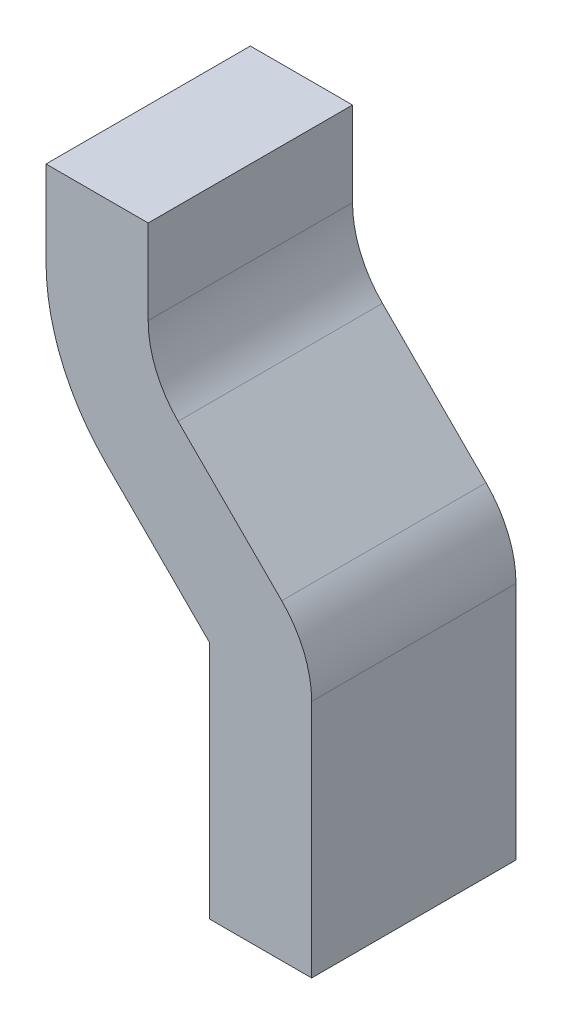
ISO-10303-21;
HEADER;
FILE_DESCRIPTION(('STEP AP214'),'2;1');
FILE_NAME('part.step','',(''),(''),'','','');
FILE_SCHEMA(('AUTOMOTIVE_DESIGN { 1 0 10303 214 1 1 1 1 }'));
ENDSEC;
DATA;
#1=APPLICATION_CONTEXT('core data for automotive mechanical design processes');
#2=APPLICATION_PROTOCOL_DEFINITION('international standard','automotive_design',2000,#1);
#3=PRODUCT_CONTEXT('',#1,'mechanical');
#4=PRODUCT('Part','Part','',(#3));
#5=PRODUCT_RELATED_PRODUCT_CATEGORY('part','',(#4));
#6=PRODUCT_DEFINITION_FORMATION('','',#4);
#7=PRODUCT_DEFINITION_CONTEXT('part definition',#1,'design');
#8=PRODUCT_DEFINITION('design','',#6,#7);
#9=PRODUCT_DEFINITION_SHAPE('','',#8);
#10=(LENGTH_UNIT() NAMED_UNIT(*) SI_UNIT(.MILLI.,.METRE.));
#11=(NAMED_UNIT(*) PLANE_ANGLE_UNIT() SI_UNIT($,.RADIAN.));
#12=(NAMED_UNIT(*) SI_UNIT($,.STERADIAN.) SOLID_ANGLE_UNIT());
#13=UNCERTAINTY_MEASURE_WITH_UNIT(LENGTH_MEASURE(1.E-05),#10,'distance_accuracy_value','');
#14=(GEOMETRIC_REPRESENTATION_CONTEXT(3) GLOBAL_UNCERTAINTY_ASSIGNED_CONTEXT((#13)) GLOBAL_UNIT_ASSIGNED_CONTEXT((#10,
#11,#12)) REPRESENTATION_CONTEXT('',''));
#15=CARTESIAN_POINT('',(0.,0.,0.));
#16=DIRECTION('',(0.,0.,1.));
#17=DIRECTION('',(1.,0.,0.));
#18=AXIS2_PLACEMENT_3D('',#15,#16,#17);
#19=CARTESIAN_POINT('',(0.,0.,1.));
#20=DIRECTION('',(0.,1.,0.));
#21=DIRECTION('',(0.,0.,1.));
#22=AXIS2_PLACEMENT_3D('',#19,#20,#21);
#23=PLANE('',#22);
#24=DIRECTION('',(1.,0.,0.));
#25=VECTOR('',#24,1.);
#26=CARTESIAN_POINT('',(0.,0.,0.));
#27=LINE('',#26,#25);
#28=CARTESIAN_POINT('',(0.,0.,0.));
#29=VERTEX_POINT('',#28);
#30=CARTESIAN_POINT('',(0.5,0.,0.));
#31=VERTEX_POINT('',#30);
#32=EDGE_CURVE('E145',#29,#31,#27,.T.);
#33=ORIENTED_EDGE('',*,*,#32,.T.);
#34=DIRECTION('',(0.,0.,-1.));
#35=VECTOR('',#34,1.);
#36=CARTESIAN_POINT('',(0.5,0.,1.));
#37=LINE('',#36,#35);
#38=CARTESIAN_POINT('',(0.5,0.,1.));
#39=VERTEX_POINT('',#38);
#40=EDGE_CURVE('E11',#39,#31,#37,.T.);
#41=ORIENTED_EDGE('',*,*,#40,.F.);
#42=DIRECTION('',(1.,0.,0.));
#43=VECTOR('',#42,1.);
#44=CARTESIAN_POINT('',(0.,0.,1.));
#45=LINE('',#44,#43);
#46=CARTESIAN_POINT('',(0.,0.,1.));
#47=VERTEX_POINT('',#46);
#48=EDGE_CURVE('E165',#47,#39,#45,.T.);
#49=ORIENTED_EDGE('',*,*,#48,.F.);
#50=DIRECTION('',(0.,0.,-1.));
#51=VECTOR('',#50,1.);
#52=CARTESIAN_POINT('',(0.,0.,1.));
#53=LINE('',#52,#51);
#54=EDGE_CURVE('E141',#47,#29,#53,.T.);
#55=ORIENTED_EDGE('',*,*,#54,.T.);
#56=EDGE_LOOP('',(#33,#41,#49,#55));
#57=FACE_BOUND('',#56,.T.);
#58=ADVANCED_FACE('F31',(#57),#23,.F.);
#59=CARTESIAN_POINT('',(0.5,0.,1.));
#60=DIRECTION('',(-1.,0.,0.));
#61=DIRECTION('',(0.,0.,1.));
#62=AXIS2_PLACEMENT_3D('',#59,#60,#61);
#63=PLANE('',#62);
#64=DIRECTION('',(0.,1.,0.));
#65=VECTOR('',#64,1.);
#66=CARTESIAN_POINT('',(0.5,0.,0.));
#67=LINE('',#66,#65);
#68=CARTESIAN_POINT('',(0.5,1.17206025648451,0.));
#69=VERTEX_POINT('',#68);
#70=EDGE_CURVE('E148',#31,#69,#67,.T.);
#71=ORIENTED_EDGE('',*,*,#70,.T.);
#72=DIRECTION('',(0.,0.,-1.));
#73=VECTOR('',#72,1.);
#74=CARTESIAN_POINT('',(0.5,1.17206025648451,1.));
#75=LINE('',#74,#73);
#76=CARTESIAN_POINT('',(0.5,1.17206025648451,1.));
#77=VERTEX_POINT('',#76);
#78=EDGE_CURVE('E39',#77,#69,#75,.T.);
#79=ORIENTED_EDGE('',*,*,#78,.F.);
#80=DIRECTION('',(0.,1.,0.));
#81=VECTOR('',#80,1.);
#82=CARTESIAN_POINT('',(0.5,0.,1.));
#83=LINE('',#82,#81);
#84=EDGE_CURVE('E99',#39,#77,#83,.T.);
#85=ORIENTED_EDGE('',*,*,#84,.F.);
#86=ORIENTED_EDGE('',*,*,#40,.T.);
#87=EDGE_LOOP('',(#71,#79,#85,#86));
#88=FACE_BOUND('',#87,.T.);
#89=ADVANCED_FACE('F237',(#88),#63,.F.);
#90=CARTESIAN_POINT('',(0.,1.17206025648451,1.));
#91=DIRECTION('',(0.,0.,-1.));
#92=DIRECTION('',(-1.,0.,0.));
#93=AXIS2_PLACEMENT_3D('',#90,#91,#92);
#94=CYLINDRICAL_SURFACE('',#93,0.499999999999997);
#95=CARTESIAN_POINT('',(0.,1.17206025648451,0.));
#96=DIRECTION('',(0.,0.,1.));
#97=DIRECTION('',(1.,0.,0.));
#98=AXIS2_PLACEMENT_3D('',#95,#96,#97);
#99=CIRCLE('',#98,0.499999999999997);
#100=CARTESIAN_POINT('',(0.353553390593275,1.52561364707778,0.));
#101=VERTEX_POINT('',#100);
#102=EDGE_CURVE('E150',#69,#101,#99,.T.);
#103=ORIENTED_EDGE('',*,*,#102,.T.);
#104=DIRECTION('',(0.,0.,-1.));
#105=VECTOR('',#104,1.);
#106=CARTESIAN_POINT('',(0.353553390593275,1.52561364707778,1.));
#107=LINE('',#106,#105);
#108=CARTESIAN_POINT('',(0.353553390593275,1.52561364707778,1.));
#109=VERTEX_POINT('',#108);
#110=EDGE_CURVE('E181',#109,#101,#107,.T.);
#111=ORIENTED_EDGE('',*,*,#110,.F.);
#112=CARTESIAN_POINT('',(0.,1.17206025648451,1.));
#113=DIRECTION('',(0.,0.,1.));
#114=DIRECTION('',(1.,0.,0.));
#115=AXIS2_PLACEMENT_3D('',#112,#113,#114);
#116=CIRCLE('',#115,0.499999999999997);
#117=EDGE_CURVE('E189',#77,#109,#116,.T.);
#118=ORIENTED_EDGE('',*,*,#117,.F.);
#119=ORIENTED_EDGE('',*,*,#78,.T.);
#120=EDGE_LOOP('',(#103,#111,#118,#119));
#121=FACE_BOUND('',#120,.T.);
#122=ADVANCED_FACE('F187',(#121),#94,.T.);
#123=CARTESIAN_POINT('',(0.353553390593273,1.52561364707778,1.));
#124=DIRECTION('',(-0.707106781186549,-0.707106781186546,0.));
#125=DIRECTION('',(0.707106781186546,-0.707106781186549,0.));
#126=AXIS2_PLACEMENT_3D('',#123,#124,#125);
#127=PLANE('',#126);
#128=DIRECTION('',(-0.707106781186546,0.707106781186549,0.));
#129=VECTOR('',#128,1.);
#130=CARTESIAN_POINT('',(0.353553390593273,1.52561364707778,0.));
#131=LINE('',#130,#129);
#132=CARTESIAN_POINT('',(-0.153553390593295,2.03272042826435,0.));
#133=VERTEX_POINT('',#132);
#134=EDGE_CURVE('E152',#101,#133,#131,.T.);
#135=ORIENTED_EDGE('',*,*,#134,.T.);
#136=DIRECTION('',(0.,0.,-1.));
#137=VECTOR('',#136,1.);
#138=CARTESIAN_POINT('',(-0.153553390593295,2.03272042826435,1.));
#139=LINE('',#138,#137);
#140=CARTESIAN_POINT('',(-0.153553390593295,2.03272042826435,1.));
#141=VERTEX_POINT('',#140);
#142=EDGE_CURVE('E178',#141,#133,#139,.T.);
#143=ORIENTED_EDGE('',*,*,#142,.F.);
#144=DIRECTION('',(-0.707106781186546,0.707106781186549,0.));
#145=VECTOR('',#144,1.);
#146=CARTESIAN_POINT('',(0.353553390593273,1.52561364707778,1.));
#147=LINE('',#146,#145);
#148=EDGE_CURVE('E207',#109,#141,#147,.T.);
#149=ORIENTED_EDGE('',*,*,#148,.F.);
#150=ORIENTED_EDGE('',*,*,#110,.T.);
#151=EDGE_LOOP('',(#135,#143,#149,#150));
#152=FACE_BOUND('',#151,.T.);
#153=ADVANCED_FACE('F198',(#152),#127,.F.);
#154=CARTESIAN_POINT('',(0.199999999999992,2.38627381885763,1.));
#155=DIRECTION('',(0.,0.,-1.));
#156=DIRECTION('',(-1.,0.,0.));
#157=AXIS2_PLACEMENT_3D('',#154,#155,#156);
#158=CYLINDRICAL_SURFACE('',#157,0.500000000000008);
#159=CARTESIAN_POINT('',(0.199999999999992,2.38627381885763,0.));
#160=DIRECTION('',(0.,0.,-1.));
#161=DIRECTION('',(-1.,0.,0.));
#162=AXIS2_PLACEMENT_3D('',#159,#160,#161);
#163=CIRCLE('',#162,0.500000000000008);
#164=CARTESIAN_POINT('',(-0.300000000000016,2.38627381885763,0.));
#165=VERTEX_POINT('',#164);
#166=EDGE_CURVE('E154',#133,#165,#163,.T.);
#167=ORIENTED_EDGE('',*,*,#166,.T.);
#168=DIRECTION('',(0.,0.,-1.));
#169=VECTOR('',#168,1.);
#170=CARTESIAN_POINT('',(-0.300000000000016,2.38627381885763,1.));
#171=LINE('',#170,#169);
#172=CARTESIAN_POINT('',(-0.300000000000016,2.38627381885763,1.));
#173=VERTEX_POINT('',#172);
#174=EDGE_CURVE('E175',#173,#165,#171,.T.);
#175=ORIENTED_EDGE('',*,*,#174,.F.);
#176=CARTESIAN_POINT('',(0.199999999999992,2.38627381885763,1.));
#177=DIRECTION('',(0.,0.,-1.));
#178=DIRECTION('',(-1.,0.,0.));
#179=AXIS2_PLACEMENT_3D('',#176,#177,#178);
#180=CIRCLE('',#179,0.500000000000008);
#181=EDGE_CURVE('E204',#141,#173,#180,.T.);
#182=ORIENTED_EDGE('',*,*,#181,.F.);
#183=ORIENTED_EDGE('',*,*,#142,.T.);
#184=EDGE_LOOP('',(#167,#175,#182,#183));
#185=FACE_BOUND('',#184,.T.);
#186=ADVANCED_FACE('F202',(#185),#158,.F.);
#187=CARTESIAN_POINT('',(-0.300000000000009,2.8,1.));
#188=DIRECTION('',(-1.,0.,0.));
#189=DIRECTION('',(0.,0.,1.));
#190=AXIS2_PLACEMENT_3D('',#187,#188,#189);
#191=PLANE('',#190);
#192=DIRECTION('',(0.,1.,0.));
#193=VECTOR('',#192,1.);
#194=CARTESIAN_POINT('',(-0.300000000000009,2.8,0.));
#195=LINE('',#194,#193);
#196=CARTESIAN_POINT('',(-0.300000000000009,2.8,0.));
#197=VERTEX_POINT('',#196);
#198=EDGE_CURVE('E156',#165,#197,#195,.T.);
#199=ORIENTED_EDGE('',*,*,#198,.T.);
#200=DIRECTION('',(0.,0.,-1.));
#201=VECTOR('',#200,1.);
#202=CARTESIAN_POINT('',(-0.300000000000009,2.8,1.));
#203=LINE('',#202,#201);
#204=CARTESIAN_POINT('',(-0.300000000000009,2.8,1.));
#205=VERTEX_POINT('',#204);
#206=EDGE_CURVE('E172',#205,#197,#203,.T.);
#207=ORIENTED_EDGE('',*,*,#206,.F.);
#208=DIRECTION('',(0.,1.,0.));
#209=VECTOR('',#208,1.);
#210=CARTESIAN_POINT('',(-0.300000000000009,2.8,1.));
#211=LINE('',#210,#209);
#212=EDGE_CURVE('E206',#173,#205,#211,.T.);
#213=ORIENTED_EDGE('',*,*,#212,.F.);
#214=ORIENTED_EDGE('',*,*,#174,.T.);
#215=EDGE_LOOP('',(#199,#207,#213,#214));
#216=FACE_BOUND('',#215,.T.);
#217=ADVANCED_FACE('F250',(#216),#191,.F.);
#218=CARTESIAN_POINT('',(-0.800000000000009,2.8,1.));
#219=DIRECTION('',(0.,-1.,0.));
#220=DIRECTION('',(0.,0.,-1.));
#221=AXIS2_PLACEMENT_3D('',#218,#219,#220);
#222=PLANE('',#221);
#223=DIRECTION('',(-1.,0.,0.));
#224=VECTOR('',#223,1.);
#225=CARTESIAN_POINT('',(-0.800000000000009,2.8,0.));
#226=LINE('',#225,#224);
#227=CARTESIAN_POINT('',(-0.800000000000009,2.8,0.));
#228=VERTEX_POINT('',#227);
#229=EDGE_CURVE('E158',#197,#228,#226,.T.);
#230=ORIENTED_EDGE('',*,*,#229,.T.);
#231=DIRECTION('',(0.,0.,-1.));
#232=VECTOR('',#231,1.);
#233=CARTESIAN_POINT('',(-0.800000000000009,2.8,1.));
#234=LINE('',#233,#232);
#235=CARTESIAN_POINT('',(-0.800000000000009,2.8,1.));
#236=VERTEX_POINT('',#235);
#237=EDGE_CURVE('E169',#236,#228,#234,.T.);
#238=ORIENTED_EDGE('',*,*,#237,.F.);
#239=DIRECTION('',(-1.,0.,0.));
#240=VECTOR('',#239,1.);
#241=CARTESIAN_POINT('',(-0.800000000000009,2.8,1.));
#242=LINE('',#241,#240);
#243=EDGE_CURVE('E209',#205,#236,#242,.T.);
#244=ORIENTED_EDGE('',*,*,#243,.F.);
#245=ORIENTED_EDGE('',*,*,#206,.T.);
#246=EDGE_LOOP('',(#230,#238,#244,#245));
#247=FACE_BOUND('',#246,.T.);
#248=ADVANCED_FACE('F218',(#247),#222,.F.);
#249=CARTESIAN_POINT('',(-0.800000000000009,2.8,1.));
#250=DIRECTION('',(1.,0.,0.));
#251=DIRECTION('',(0.,0.,-1.));
#252=AXIS2_PLACEMENT_3D('',#249,#250,#251);
#253=PLANE('',#252);
#254=DIRECTION('',(0.,-1.,0.));
#255=VECTOR('',#254,1.);
#256=CARTESIAN_POINT('',(-0.800000000000009,2.8,0.));
#257=LINE('',#256,#255);
#258=CARTESIAN_POINT('',(-0.800000000000009,2.38627381885763,0.));
#259=VERTEX_POINT('',#258);
#260=EDGE_CURVE('E160',#228,#259,#257,.T.);
#261=ORIENTED_EDGE('',*,*,#260,.T.);
#262=DIRECTION('',(0.,0.,-1.));
#263=VECTOR('',#262,1.);
#264=CARTESIAN_POINT('',(-0.800000000000009,2.38627381885763,1.));
#265=LINE('',#264,#263);
#266=CARTESIAN_POINT('',(-0.800000000000009,2.38627381885763,1.));
#267=VERTEX_POINT('',#266);
#268=EDGE_CURVE('E136',#267,#259,#265,.T.);
#269=ORIENTED_EDGE('',*,*,#268,.F.);
#270=DIRECTION('',(0.,-1.,0.));
#271=VECTOR('',#270,1.);
#272=CARTESIAN_POINT('',(-0.800000000000009,2.8,1.));
#273=LINE('',#272,#271);
#274=EDGE_CURVE('E127',#236,#267,#273,.T.);
#275=ORIENTED_EDGE('',*,*,#274,.F.);
#276=ORIENTED_EDGE('',*,*,#237,.T.);
#277=EDGE_LOOP('',(#261,#269,#275,#276));
#278=FACE_BOUND('',#277,.T.);
#279=ADVANCED_FACE('F222',(#278),#253,.F.);
#280=CARTESIAN_POINT('',(0.199999999999992,2.38627381885763,1.));
#281=DIRECTION('',(0.,0.,-1.));
#282=DIRECTION('',(-1.,0.,0.));
#283=AXIS2_PLACEMENT_3D('',#280,#281,#282);
#284=CYLINDRICAL_SURFACE('',#283,0.999999999999999);
#285=CARTESIAN_POINT('',(0.199999999999992,2.38627381885763,0.));
#286=DIRECTION('',(0.,0.,1.));
#287=DIRECTION('',(-1.,0.,0.));
#288=AXIS2_PLACEMENT_3D('',#285,#286,#287);
#289=CIRCLE('',#288,0.999999999999999);
#290=CARTESIAN_POINT('',(-0.507106781186555,1.67916703767108,0.));
#291=VERTEX_POINT('',#290);
#292=EDGE_CURVE('E135',#259,#291,#289,.T.);
#293=ORIENTED_EDGE('',*,*,#292,.T.);
#294=DIRECTION('',(0.,0.,-1.));
#295=VECTOR('',#294,1.);
#296=CARTESIAN_POINT('',(-0.507106781186555,1.67916703767108,1.));
#297=LINE('',#296,#295);
#298=CARTESIAN_POINT('',(-0.507106781186555,1.67916703767108,1.));
#299=VERTEX_POINT('',#298);
#300=EDGE_CURVE('E132',#299,#291,#297,.T.);
#301=ORIENTED_EDGE('',*,*,#300,.F.);
#302=CARTESIAN_POINT('',(0.199999999999992,2.38627381885763,1.));
#303=DIRECTION('',(0.,0.,1.));
#304=DIRECTION('',(-1.,0.,0.));
#305=AXIS2_PLACEMENT_3D('',#302,#303,#304);
#306=CIRCLE('',#305,0.999999999999999);
#307=EDGE_CURVE('E121',#267,#299,#306,.T.);
#308=ORIENTED_EDGE('',*,*,#307,.F.);
#309=ORIENTED_EDGE('',*,*,#268,.T.);
#310=EDGE_LOOP('',(#293,#301,#308,#309));
#311=FACE_BOUND('',#310,.T.);
#312=ADVANCED_FACE('F133',(#311),#284,.T.);
#313=CARTESIAN_POINT('',(0.,1.17206025648454,1.));
#314=DIRECTION('',(0.707106781186546,0.707106781186549,0.));
#315=DIRECTION('',(-0.707106781186549,0.707106781186546,0.));
#316=AXIS2_PLACEMENT_3D('',#313,#314,#315);
#317=PLANE('',#316);
#318=DIRECTION('',(0.707106781186549,-0.707106781186546,0.));
#319=VECTOR('',#318,1.);
#320=CARTESIAN_POINT('',(0.,1.17206025648454,0.));
#321=LINE('',#320,#319);
#322=CARTESIAN_POINT('',(0.,1.17206025648454,0.));
#323=VERTEX_POINT('',#322);
#324=EDGE_CURVE('E85',#291,#323,#321,.T.);
#325=ORIENTED_EDGE('',*,*,#324,.T.);
#326=DIRECTION('',(0.,0.,-1.));
#327=VECTOR('',#326,1.);
#328=CARTESIAN_POINT('',(0.,1.17206025648454,1.));
#329=LINE('',#328,#327);
#330=CARTESIAN_POINT('',(0.,1.17206025648454,1.));
#331=VERTEX_POINT('',#330);
#332=EDGE_CURVE('E137',#331,#323,#329,.T.);
#333=ORIENTED_EDGE('',*,*,#332,.F.);
#334=DIRECTION('',(0.707106781186549,-0.707106781186546,0.));
#335=VECTOR('',#334,1.);
#336=CARTESIAN_POINT('',(0.,1.17206025648454,1.));
#337=LINE('',#336,#335);
#338=EDGE_CURVE('E125',#299,#331,#337,.T.);
#339=ORIENTED_EDGE('',*,*,#338,.F.);
#340=ORIENTED_EDGE('',*,*,#300,.T.);
#341=EDGE_LOOP('',(#325,#333,#339,#340));
#342=FACE_BOUND('',#341,.T.);
#343=ADVANCED_FACE('F139',(#342),#317,.F.);
#344=CARTESIAN_POINT('',(0.,0.,1.));
#345=DIRECTION('',(1.,0.,0.));
#346=DIRECTION('',(0.,0.,-1.));
#347=AXIS2_PLACEMENT_3D('',#344,#345,#346);
#348=PLANE('',#347);
#349=DIRECTION('',(0.,-1.,0.));
#350=VECTOR('',#349,1.);
#351=CARTESIAN_POINT('',(0.,0.,0.));
#352=LINE('',#351,#350);
#353=EDGE_CURVE('E91',#323,#29,#352,.T.);
#354=ORIENTED_EDGE('',*,*,#353,.T.);
#355=ORIENTED_EDGE('',*,*,#54,.F.);
#356=DIRECTION('',(0.,-1.,0.));
#357=VECTOR('',#356,1.);
#358=CARTESIAN_POINT('',(0.,0.,1.));
#359=LINE('',#358,#357);
#360=EDGE_CURVE('E47',#331,#47,#359,.T.);
#361=ORIENTED_EDGE('',*,*,#360,.F.);
#362=ORIENTED_EDGE('',*,*,#332,.T.);
#363=EDGE_LOOP('',(#354,#355,#361,#362));
#364=FACE_BOUND('',#363,.T.);
#365=ADVANCED_FACE('F226',(#364),#348,.F.);
#366=CARTESIAN_POINT('',(0.,1.17206025648451,1.));
#367=DIRECTION('',(0.,0.,1.));
#368=DIRECTION('',(1.,0.,0.));
#369=AXIS2_PLACEMENT_3D('',#366,#367,#368);
#370=PLANE('',#369);
#371=ORIENTED_EDGE('',*,*,#48,.T.);
#372=ORIENTED_EDGE('',*,*,#84,.T.);
#373=ORIENTED_EDGE('',*,*,#117,.T.);
#374=ORIENTED_EDGE('',*,*,#148,.T.);
#375=ORIENTED_EDGE('',*,*,#181,.T.);
#376=ORIENTED_EDGE('',*,*,#212,.T.);
#377=ORIENTED_EDGE('',*,*,#243,.T.);
#378=ORIENTED_EDGE('',*,*,#274,.T.);
#379=ORIENTED_EDGE('',*,*,#307,.T.);
#380=ORIENTED_EDGE('',*,*,#338,.T.);
#381=ORIENTED_EDGE('',*,*,#360,.T.);
#382=EDGE_LOOP('',(#371,#372,#373,#374,#375,#376,#377,#378,#379,#380,#381));
#383=FACE_BOUND('',#382,.T.);
#384=ADVANCED_FACE('F123',(#383),#370,.T.);
#385=CARTESIAN_POINT('',(0.,1.17206025648451,0.));
#386=DIRECTION('',(0.,0.,1.));
#387=DIRECTION('',(1.,0.,0.));
#388=AXIS2_PLACEMENT_3D('',#385,#386,#387);
#389=PLANE('',#388);
#390=ORIENTED_EDGE('',*,*,#32,.F.);
#391=ORIENTED_EDGE('',*,*,#353,.F.);
#392=ORIENTED_EDGE('',*,*,#324,.F.);
#393=ORIENTED_EDGE('',*,*,#292,.F.);
#394=ORIENTED_EDGE('',*,*,#260,.F.);
#395=ORIENTED_EDGE('',*,*,#229,.F.);
#396=ORIENTED_EDGE('',*,*,#198,.F.);
#397=ORIENTED_EDGE('',*,*,#166,.F.);
#398=ORIENTED_EDGE('',*,*,#134,.F.);
#399=ORIENTED_EDGE('',*,*,#102,.F.);
#400=ORIENTED_EDGE('',*,*,#70,.F.);
#401=EDGE_LOOP('',(#390,#391,#392,#393,#394,#395,#396,#397,#398,#399,#400));
#402=FACE_BOUND('',#401,.T.);
#403=ADVANCED_FACE('F193',(#402),#389,.F.);
#404=CLOSED_SHELL('',(#58,#89,#122,#153,#186,#217,#248,#279,#312,#343,#365,#384,#403));
#405=MANIFOLD_SOLID_BREP('B2',#404);
#406=ADVANCED_BREP_SHAPE_REPRESENTATION('',(#18,#405),#14);
#407=SHAPE_DEFINITION_REPRESENTATION(#9,#406);
ENDSEC;
END-ISO-10303-21;
